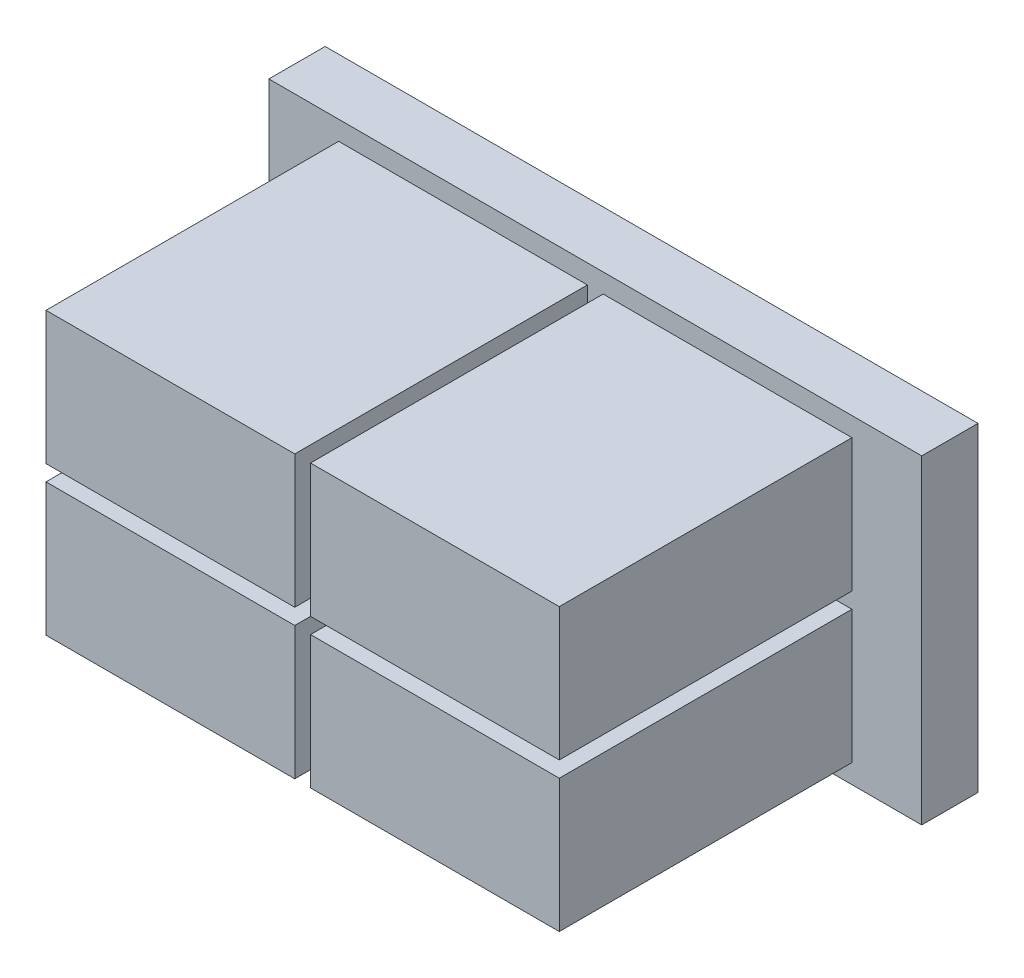
ISO-10303-21;
HEADER;
FILE_DESCRIPTION(('STEP AP214'),'2;1');
FILE_NAME('part.step','',(''),(''),'','','');
FILE_SCHEMA(('AUTOMOTIVE_DESIGN { 1 0 10303 214 1 1 1 1 }'));
ENDSEC;
DATA;
#1=APPLICATION_CONTEXT('core data for automotive mechanical design processes');
#2=APPLICATION_PROTOCOL_DEFINITION('international standard','automotive_design',2000,#1);
#3=PRODUCT_CONTEXT('',#1,'mechanical');
#4=PRODUCT('Part','Part','',(#3));
#5=PRODUCT_RELATED_PRODUCT_CATEGORY('part','',(#4));
#6=PRODUCT_DEFINITION_FORMATION('','',#4);
#7=PRODUCT_DEFINITION_CONTEXT('part definition',#1,'design');
#8=PRODUCT_DEFINITION('design','',#6,#7);
#9=PRODUCT_DEFINITION_SHAPE('','',#8);
#10=(LENGTH_UNIT() NAMED_UNIT(*) SI_UNIT(.MILLI.,.METRE.));
#11=(NAMED_UNIT(*) PLANE_ANGLE_UNIT() SI_UNIT($,.RADIAN.));
#12=(NAMED_UNIT(*) SI_UNIT($,.STERADIAN.) SOLID_ANGLE_UNIT());
#13=UNCERTAINTY_MEASURE_WITH_UNIT(LENGTH_MEASURE(1.E-05),#10,'distance_accuracy_value','');
#14=(GEOMETRIC_REPRESENTATION_CONTEXT(3) GLOBAL_UNCERTAINTY_ASSIGNED_CONTEXT((#13)) GLOBAL_UNIT_ASSIGNED_CONTEXT((#10,
#11,#12)) REPRESENTATION_CONTEXT('',''));
#15=CARTESIAN_POINT('',(0.,0.,0.));
#16=DIRECTION('',(0.,0.,1.));
#17=DIRECTION('',(1.,0.,0.));
#18=AXIS2_PLACEMENT_3D('',#15,#16,#17);
#19=CARTESIAN_POINT('',(0.,0.,2.5));
#20=DIRECTION('',(0.,0.,1.));
#21=DIRECTION('',(1.,0.,0.));
#22=AXIS2_PLACEMENT_3D('',#19,#20,#21);
#23=PLANE('',#22);
#24=DIRECTION('',(0.,1.,0.));
#25=VECTOR('',#24,1.);
#26=CARTESIAN_POINT('',(14.5,7.1,2.5));
#27=LINE('',#26,#25);
#28=CARTESIAN_POINT('',(14.5,-7.1,2.5));
#29=VERTEX_POINT('',#28);
#30=CARTESIAN_POINT('',(14.5,7.1,2.5));
#31=VERTEX_POINT('',#30);
#32=EDGE_CURVE('E286',#29,#31,#27,.T.);
#33=ORIENTED_EDGE('',*,*,#32,.T.);
#34=DIRECTION('',(-1.,0.,0.));
#35=VECTOR('',#34,1.);
#36=CARTESIAN_POINT('',(-14.5,7.1,2.5));
#37=LINE('',#36,#35);
#38=CARTESIAN_POINT('',(-14.5,7.1,2.5));
#39=VERTEX_POINT('',#38);
#40=EDGE_CURVE('E289',#31,#39,#37,.T.);
#41=ORIENTED_EDGE('',*,*,#40,.T.);
#42=DIRECTION('',(0.,-1.,0.));
#43=VECTOR('',#42,1.);
#44=CARTESIAN_POINT('',(-14.5,7.1,2.5));
#45=LINE('',#44,#43);
#46=CARTESIAN_POINT('',(-14.5,-7.1,2.5));
#47=VERTEX_POINT('',#46);
#48=EDGE_CURVE('E292',#39,#47,#45,.T.);
#49=ORIENTED_EDGE('',*,*,#48,.T.);
#50=DIRECTION('',(1.,0.,0.));
#51=VECTOR('',#50,1.);
#52=CARTESIAN_POINT('',(-14.5,-7.1,2.5));
#53=LINE('',#52,#51);
#54=EDGE_CURVE('E294',#47,#29,#53,.T.);
#55=ORIENTED_EDGE('',*,*,#54,.T.);
#56=EDGE_LOOP('',(#33,#41,#49,#55));
#57=FACE_BOUND('',#56,.T.);
#58=DIRECTION('',(-1.,0.,0.));
#59=VECTOR('',#58,1.);
#60=CARTESIAN_POINT('',(0.35,-0.35,2.5));
#61=LINE('',#60,#59);
#62=CARTESIAN_POINT('',(11.4,-0.35,2.5));
#63=VERTEX_POINT('',#62);
#64=CARTESIAN_POINT('',(0.35,-0.35,2.5));
#65=VERTEX_POINT('',#64);
#66=EDGE_CURVE('E270',#63,#65,#61,.T.);
#67=ORIENTED_EDGE('',*,*,#66,.F.);
#68=DIRECTION('',(0.,1.,0.));
#69=VECTOR('',#68,1.);
#70=CARTESIAN_POINT('',(11.4,-0.35,2.5));
#71=LINE('',#70,#69);
#72=CARTESIAN_POINT('',(11.4,-6.25,2.5));
#73=VERTEX_POINT('',#72);
#74=EDGE_CURVE('E256',#73,#63,#71,.T.);
#75=ORIENTED_EDGE('',*,*,#74,.F.);
#76=DIRECTION('',(1.,0.,0.));
#77=VECTOR('',#76,1.);
#78=CARTESIAN_POINT('',(0.35,-6.25,2.5));
#79=LINE('',#78,#77);
#80=CARTESIAN_POINT('',(0.35,-6.25,2.5));
#81=VERTEX_POINT('',#80);
#82=EDGE_CURVE('E261',#81,#73,#79,.T.);
#83=ORIENTED_EDGE('',*,*,#82,.F.);
#84=DIRECTION('',(0.,-1.,0.));
#85=VECTOR('',#84,1.);
#86=CARTESIAN_POINT('',(0.35,-0.35,2.5));
#87=LINE('',#86,#85);
#88=EDGE_CURVE('E272',#65,#81,#87,.T.);
#89=ORIENTED_EDGE('',*,*,#88,.F.);
#90=EDGE_LOOP('',(#67,#75,#83,#89));
#91=FACE_BOUND('',#90,.T.);
#92=DIRECTION('',(1.,0.,0.));
#93=VECTOR('',#92,1.);
#94=CARTESIAN_POINT('',(-11.4,0.35,2.5));
#95=LINE('',#94,#93);
#96=CARTESIAN_POINT('',(-11.4,0.35,2.5));
#97=VERTEX_POINT('',#96);
#98=CARTESIAN_POINT('',(-0.350000000000001,0.349999999999999,2.5));
#99=VERTEX_POINT('',#98);
#100=EDGE_CURVE('E241',#97,#99,#95,.T.);
#101=ORIENTED_EDGE('',*,*,#100,.F.);
#102=DIRECTION('',(0.,-1.,0.));
#103=VECTOR('',#102,1.);
#104=CARTESIAN_POINT('',(-11.4,6.25,2.5));
#105=LINE('',#104,#103);
#106=CARTESIAN_POINT('',(-11.4,6.25,2.5));
#107=VERTEX_POINT('',#106);
#108=EDGE_CURVE('E227',#107,#97,#105,.T.);
#109=ORIENTED_EDGE('',*,*,#108,.F.);
#110=DIRECTION('',(-1.,0.,0.));
#111=VECTOR('',#110,1.);
#112=CARTESIAN_POINT('',(-11.4,6.25,2.5));
#113=LINE('',#112,#111);
#114=CARTESIAN_POINT('',(-0.35,6.25,2.5));
#115=VERTEX_POINT('',#114);
#116=EDGE_CURVE('E232',#115,#107,#113,.T.);
#117=ORIENTED_EDGE('',*,*,#116,.F.);
#118=DIRECTION('',(0.,1.,0.));
#119=VECTOR('',#118,1.);
#120=CARTESIAN_POINT('',(-0.35,6.25,2.5));
#121=LINE('',#120,#119);
#122=EDGE_CURVE('E243',#99,#115,#121,.T.);
#123=ORIENTED_EDGE('',*,*,#122,.F.);
#124=EDGE_LOOP('',(#101,#109,#117,#123));
#125=FACE_BOUND('',#124,.T.);
#126=DIRECTION('',(1.,0.,0.));
#127=VECTOR('',#126,1.);
#128=CARTESIAN_POINT('',(-11.4,-6.25,2.5));
#129=LINE('',#128,#127);
#130=CARTESIAN_POINT('',(-11.4,-6.25,2.5));
#131=VERTEX_POINT('',#130);
#132=CARTESIAN_POINT('',(-0.35,-6.25,2.5));
#133=VERTEX_POINT('',#132);
#134=EDGE_CURVE('E199',#131,#133,#129,.T.);
#135=ORIENTED_EDGE('',*,*,#134,.F.);
#136=DIRECTION('',(0.,-1.,0.));
#137=VECTOR('',#136,1.);
#138=CARTESIAN_POINT('',(-11.4,-0.35,2.5));
#139=LINE('',#138,#137);
#140=CARTESIAN_POINT('',(-11.4,-0.35,2.5));
#141=VERTEX_POINT('',#140);
#142=EDGE_CURVE('E196',#141,#131,#139,.T.);
#143=ORIENTED_EDGE('',*,*,#142,.F.);
#144=DIRECTION('',(-1.,0.,0.));
#145=VECTOR('',#144,1.);
#146=CARTESIAN_POINT('',(-11.4,-0.35,2.5));
#147=LINE('',#146,#145);
#148=CARTESIAN_POINT('',(-0.350000000000001,-0.350000000000001,2.5));
#149=VERTEX_POINT('',#148);
#150=EDGE_CURVE('E208',#149,#141,#147,.T.);
#151=ORIENTED_EDGE('',*,*,#150,.F.);
#152=DIRECTION('',(0.,1.,0.));
#153=VECTOR('',#152,1.);
#154=CARTESIAN_POINT('',(-0.350000000000001,-0.350000000000001,2.5));
#155=LINE('',#154,#153);
#156=EDGE_CURVE('E216',#133,#149,#155,.T.);
#157=ORIENTED_EDGE('',*,*,#156,.F.);
#158=EDGE_LOOP('',(#135,#143,#151,#157));
#159=FACE_BOUND('',#158,.T.);
#160=DIRECTION('',(0.,-1.,0.));
#161=VECTOR('',#160,1.);
#162=CARTESIAN_POINT('',(0.35,6.25,2.5));
#163=LINE('',#162,#161);
#164=CARTESIAN_POINT('',(0.35,6.25,2.5));
#165=VERTEX_POINT('',#164);
#166=CARTESIAN_POINT('',(0.349999999999998,0.349999999999999,2.5));
#167=VERTEX_POINT('',#166);
#168=EDGE_CURVE('E575',#165,#167,#163,.T.);
#169=ORIENTED_EDGE('',*,*,#168,.F.);
#170=DIRECTION('',(-1.,0.,0.));
#171=VECTOR('',#170,1.);
#172=CARTESIAN_POINT('',(0.35,6.25,2.5));
#173=LINE('',#172,#171);
#174=CARTESIAN_POINT('',(11.4,6.25,2.5));
#175=VERTEX_POINT('',#174);
#176=EDGE_CURVE('E194',#175,#165,#173,.T.);
#177=ORIENTED_EDGE('',*,*,#176,.F.);
#178=DIRECTION('',(0.,1.,0.));
#179=VECTOR('',#178,1.);
#180=CARTESIAN_POINT('',(11.4,6.25,2.5));
#181=LINE('',#180,#179);
#182=CARTESIAN_POINT('',(11.4,0.35,2.5));
#183=VERTEX_POINT('',#182);
#184=EDGE_CURVE('E190',#183,#175,#181,.T.);
#185=ORIENTED_EDGE('',*,*,#184,.F.);
#186=DIRECTION('',(1.,0.,0.));
#187=VECTOR('',#186,1.);
#188=CARTESIAN_POINT('',(0.349999999999998,0.349999999999999,2.5));
#189=LINE('',#188,#187);
#190=EDGE_CURVE('E572',#167,#183,#189,.T.);
#191=ORIENTED_EDGE('',*,*,#190,.F.);
#192=EDGE_LOOP('',(#169,#177,#185,#191));
#193=FACE_BOUND('',#192,.T.);
#194=ADVANCED_FACE('F33',(#57,#91,#125,#159,#193),#23,.T.);
#195=CARTESIAN_POINT('',(14.5,7.1,2.5));
#196=DIRECTION('',(-1.,0.,0.));
#197=DIRECTION('',(0.,-1.,0.));
#198=AXIS2_PLACEMENT_3D('',#195,#196,#197);
#199=PLANE('',#198);
#200=DIRECTION('',(0.,1.,0.));
#201=VECTOR('',#200,1.);
#202=CARTESIAN_POINT('',(14.5,7.1,0.));
#203=LINE('',#202,#201);
#204=CARTESIAN_POINT('',(14.5,-7.1,0.));
#205=VERTEX_POINT('',#204);
#206=CARTESIAN_POINT('',(14.5,7.1,0.));
#207=VERTEX_POINT('',#206);
#208=EDGE_CURVE('E285',#205,#207,#203,.T.);
#209=ORIENTED_EDGE('',*,*,#208,.T.);
#210=DIRECTION('',(0.,0.,-1.));
#211=VECTOR('',#210,1.);
#212=CARTESIAN_POINT('',(14.5,7.1,2.5));
#213=LINE('',#212,#211);
#214=EDGE_CURVE('E11',#31,#207,#213,.T.);
#215=ORIENTED_EDGE('',*,*,#214,.F.);
#216=ORIENTED_EDGE('',*,*,#32,.F.);
#217=DIRECTION('',(0.,0.,-1.));
#218=VECTOR('',#217,1.);
#219=CARTESIAN_POINT('',(14.5,-7.1,2.5));
#220=LINE('',#219,#218);
#221=EDGE_CURVE('E296',#29,#205,#220,.T.);
#222=ORIENTED_EDGE('',*,*,#221,.T.);
#223=EDGE_LOOP('',(#209,#215,#216,#222));
#224=FACE_BOUND('',#223,.T.);
#225=ADVANCED_FACE('F35',(#224),#199,.F.);
#226=CARTESIAN_POINT('',(-14.5,7.1,2.5));
#227=DIRECTION('',(0.,-1.,0.));
#228=DIRECTION('',(0.,0.,-1.));
#229=AXIS2_PLACEMENT_3D('',#226,#227,#228);
#230=PLANE('',#229);
#231=DIRECTION('',(-1.,0.,0.));
#232=VECTOR('',#231,1.);
#233=CARTESIAN_POINT('',(-14.5,7.1,0.));
#234=LINE('',#233,#232);
#235=CARTESIAN_POINT('',(-14.5,7.1,0.));
#236=VERTEX_POINT('',#235);
#237=EDGE_CURVE('E299',#207,#236,#234,.T.);
#238=ORIENTED_EDGE('',*,*,#237,.T.);
#239=DIRECTION('',(0.,0.,-1.));
#240=VECTOR('',#239,1.);
#241=CARTESIAN_POINT('',(-14.5,7.1,2.5));
#242=LINE('',#241,#240);
#243=EDGE_CURVE('E41',#39,#236,#242,.T.);
#244=ORIENTED_EDGE('',*,*,#243,.F.);
#245=ORIENTED_EDGE('',*,*,#40,.F.);
#246=ORIENTED_EDGE('',*,*,#214,.T.);
#247=EDGE_LOOP('',(#238,#244,#245,#246));
#248=FACE_BOUND('',#247,.T.);
#249=ADVANCED_FACE('F329',(#248),#230,.F.);
#250=CARTESIAN_POINT('',(-14.5,7.1,2.5));
#251=DIRECTION('',(1.,0.,0.));
#252=DIRECTION('',(0.,1.,0.));
#253=AXIS2_PLACEMENT_3D('',#250,#251,#252);
#254=PLANE('',#253);
#255=DIRECTION('',(0.,-1.,0.));
#256=VECTOR('',#255,1.);
#257=CARTESIAN_POINT('',(-14.5,7.1,0.));
#258=LINE('',#257,#256);
#259=CARTESIAN_POINT('',(-14.5,-7.1,0.));
#260=VERTEX_POINT('',#259);
#261=EDGE_CURVE('E301',#236,#260,#258,.T.);
#262=ORIENTED_EDGE('',*,*,#261,.T.);
#263=DIRECTION('',(0.,0.,-1.));
#264=VECTOR('',#263,1.);
#265=CARTESIAN_POINT('',(-14.5,-7.1,2.5));
#266=LINE('',#265,#264);
#267=EDGE_CURVE('E306',#47,#260,#266,.T.);
#268=ORIENTED_EDGE('',*,*,#267,.F.);
#269=ORIENTED_EDGE('',*,*,#48,.F.);
#270=ORIENTED_EDGE('',*,*,#243,.T.);
#271=EDGE_LOOP('',(#262,#268,#269,#270));
#272=FACE_BOUND('',#271,.T.);
#273=ADVANCED_FACE('F313',(#272),#254,.F.);
#274=CARTESIAN_POINT('',(-14.5,-7.1,2.5));
#275=DIRECTION('',(0.,1.,0.));
#276=DIRECTION('',(0.,0.,1.));
#277=AXIS2_PLACEMENT_3D('',#274,#275,#276);
#278=PLANE('',#277);
#279=DIRECTION('',(1.,0.,0.));
#280=VECTOR('',#279,1.);
#281=CARTESIAN_POINT('',(-14.5,-7.1,0.));
#282=LINE('',#281,#280);
#283=EDGE_CURVE('E290',#260,#205,#282,.T.);
#284=ORIENTED_EDGE('',*,*,#283,.T.);
#285=ORIENTED_EDGE('',*,*,#221,.F.);
#286=ORIENTED_EDGE('',*,*,#54,.F.);
#287=ORIENTED_EDGE('',*,*,#267,.T.);
#288=EDGE_LOOP('',(#284,#285,#286,#287));
#289=FACE_BOUND('',#288,.T.);
#290=ADVANCED_FACE('F322',(#289),#278,.F.);
#291=CARTESIAN_POINT('',(0.,0.,0.));
#292=DIRECTION('',(0.,0.,1.));
#293=DIRECTION('',(1.,0.,0.));
#294=AXIS2_PLACEMENT_3D('',#291,#292,#293);
#295=PLANE('',#294);
#296=ORIENTED_EDGE('',*,*,#208,.F.);
#297=ORIENTED_EDGE('',*,*,#283,.F.);
#298=ORIENTED_EDGE('',*,*,#261,.F.);
#299=ORIENTED_EDGE('',*,*,#237,.F.);
#300=EDGE_LOOP('',(#296,#297,#298,#299));
#301=FACE_BOUND('',#300,.T.);
#302=ADVANCED_FACE('F319',(#301),#295,.F.);
#303=CARTESIAN_POINT('',(11.4,-0.35,15.5));
#304=DIRECTION('',(-1.,0.,0.));
#305=DIRECTION('',(0.,-1.,0.));
#306=AXIS2_PLACEMENT_3D('',#303,#304,#305);
#307=PLANE('',#306);
#308=ORIENTED_EDGE('',*,*,#74,.T.);
#309=DIRECTION('',(0.,0.,-1.));
#310=VECTOR('',#309,1.);
#311=CARTESIAN_POINT('',(11.4,-0.35,15.5));
#312=LINE('',#311,#310);
#313=CARTESIAN_POINT('',(11.4,-0.35,15.5));
#314=VERTEX_POINT('',#313);
#315=EDGE_CURVE('E283',#314,#63,#312,.T.);
#316=ORIENTED_EDGE('',*,*,#315,.F.);
#317=DIRECTION('',(0.,1.,0.));
#318=VECTOR('',#317,1.);
#319=CARTESIAN_POINT('',(11.4,-0.35,15.5));
#320=LINE('',#319,#318);
#321=CARTESIAN_POINT('',(11.4,-6.25,15.5));
#322=VERTEX_POINT('',#321);
#323=EDGE_CURVE('E257',#322,#314,#320,.T.);
#324=ORIENTED_EDGE('',*,*,#323,.F.);
#325=DIRECTION('',(0.,0.,-1.));
#326=VECTOR('',#325,1.);
#327=CARTESIAN_POINT('',(11.4,-6.25,15.5));
#328=LINE('',#327,#326);
#329=EDGE_CURVE('E267',#322,#73,#328,.T.);
#330=ORIENTED_EDGE('',*,*,#329,.T.);
#331=EDGE_LOOP('',(#308,#316,#324,#330));
#332=FACE_BOUND('',#331,.T.);
#333=ADVANCED_FACE('F342',(#332),#307,.F.);
#334=CARTESIAN_POINT('',(0.35,-0.35,15.5));
#335=DIRECTION('',(0.,-1.,0.));
#336=DIRECTION('',(1.,0.,0.));
#337=AXIS2_PLACEMENT_3D('',#334,#335,#336);
#338=PLANE('',#337);
#339=ORIENTED_EDGE('',*,*,#66,.T.);
#340=DIRECTION('',(0.,0.,-1.));
#341=VECTOR('',#340,1.);
#342=CARTESIAN_POINT('',(0.35,-0.35,15.5));
#343=LINE('',#342,#341);
#344=CARTESIAN_POINT('',(0.35,-0.35,15.5));
#345=VERTEX_POINT('',#344);
#346=EDGE_CURVE('E280',#345,#65,#343,.T.);
#347=ORIENTED_EDGE('',*,*,#346,.F.);
#348=DIRECTION('',(-1.,0.,0.));
#349=VECTOR('',#348,1.);
#350=CARTESIAN_POINT('',(0.35,-0.35,15.5));
#351=LINE('',#350,#349);
#352=EDGE_CURVE('E260',#314,#345,#351,.T.);
#353=ORIENTED_EDGE('',*,*,#352,.F.);
#354=ORIENTED_EDGE('',*,*,#315,.T.);
#355=EDGE_LOOP('',(#339,#347,#353,#354));
#356=FACE_BOUND('',#355,.T.);
#357=ADVANCED_FACE('F361',(#356),#338,.F.);
#358=CARTESIAN_POINT('',(0.35,-0.35,15.5));
#359=DIRECTION('',(1.,0.,0.));
#360=DIRECTION('',(0.,1.,0.));
#361=AXIS2_PLACEMENT_3D('',#358,#359,#360);
#362=PLANE('',#361);
#363=ORIENTED_EDGE('',*,*,#88,.T.);
#364=DIRECTION('',(0.,0.,-1.));
#365=VECTOR('',#364,1.);
#366=CARTESIAN_POINT('',(0.35,-6.25,15.5));
#367=LINE('',#366,#365);
#368=CARTESIAN_POINT('',(0.35,-6.25,15.5));
#369=VERTEX_POINT('',#368);
#370=EDGE_CURVE('E278',#369,#81,#367,.T.);
#371=ORIENTED_EDGE('',*,*,#370,.F.);
#372=DIRECTION('',(0.,-1.,0.));
#373=VECTOR('',#372,1.);
#374=CARTESIAN_POINT('',(0.35,-0.35,15.5));
#375=LINE('',#374,#373);
#376=EDGE_CURVE('E263',#345,#369,#375,.T.);
#377=ORIENTED_EDGE('',*,*,#376,.F.);
#378=ORIENTED_EDGE('',*,*,#346,.T.);
#379=EDGE_LOOP('',(#363,#371,#377,#378));
#380=FACE_BOUND('',#379,.T.);
#381=ADVANCED_FACE('F368',(#380),#362,.F.);
#382=CARTESIAN_POINT('',(0.35,-6.25,15.5));
#383=DIRECTION('',(0.,1.,0.));
#384=DIRECTION('',(0.,0.,1.));
#385=AXIS2_PLACEMENT_3D('',#382,#383,#384);
#386=PLANE('',#385);
#387=ORIENTED_EDGE('',*,*,#82,.T.);
#388=ORIENTED_EDGE('',*,*,#329,.F.);
#389=DIRECTION('',(1.,0.,0.));
#390=VECTOR('',#389,1.);
#391=CARTESIAN_POINT('',(0.35,-6.25,15.5));
#392=LINE('',#391,#390);
#393=EDGE_CURVE('E265',#369,#322,#392,.T.);
#394=ORIENTED_EDGE('',*,*,#393,.F.);
#395=ORIENTED_EDGE('',*,*,#370,.T.);
#396=EDGE_LOOP('',(#387,#388,#394,#395));
#397=FACE_BOUND('',#396,.T.);
#398=ADVANCED_FACE('F375',(#397),#386,.F.);
#399=CARTESIAN_POINT('',(0.,0.,15.5));
#400=DIRECTION('',(0.,0.,1.));
#401=DIRECTION('',(1.,0.,0.));
#402=AXIS2_PLACEMENT_3D('',#399,#400,#401);
#403=PLANE('',#402);
#404=ORIENTED_EDGE('',*,*,#323,.T.);
#405=ORIENTED_EDGE('',*,*,#352,.T.);
#406=ORIENTED_EDGE('',*,*,#376,.T.);
#407=ORIENTED_EDGE('',*,*,#393,.T.);
#408=EDGE_LOOP('',(#404,#405,#406,#407));
#409=FACE_BOUND('',#408,.T.);
#410=ADVANCED_FACE('F383',(#409),#403,.T.);
#411=CARTESIAN_POINT('',(-11.4,6.25,15.5));
#412=DIRECTION('',(1.,0.,0.));
#413=DIRECTION('',(0.,1.,0.));
#414=AXIS2_PLACEMENT_3D('',#411,#412,#413);
#415=PLANE('',#414);
#416=ORIENTED_EDGE('',*,*,#108,.T.);
#417=DIRECTION('',(0.,0.,-1.));
#418=VECTOR('',#417,1.);
#419=CARTESIAN_POINT('',(-11.4,0.35,15.5));
#420=LINE('',#419,#418);
#421=CARTESIAN_POINT('',(-11.4,0.35,15.5));
#422=VERTEX_POINT('',#421);
#423=EDGE_CURVE('E254',#422,#97,#420,.T.);
#424=ORIENTED_EDGE('',*,*,#423,.F.);
#425=DIRECTION('',(0.,-1.,0.));
#426=VECTOR('',#425,1.);
#427=CARTESIAN_POINT('',(-11.4,6.25,15.5));
#428=LINE('',#427,#426);
#429=CARTESIAN_POINT('',(-11.4,6.25,15.5));
#430=VERTEX_POINT('',#429);
#431=EDGE_CURVE('E228',#430,#422,#428,.T.);
#432=ORIENTED_EDGE('',*,*,#431,.F.);
#433=DIRECTION('',(0.,0.,-1.));
#434=VECTOR('',#433,1.);
#435=CARTESIAN_POINT('',(-11.4,6.25,15.5));
#436=LINE('',#435,#434);
#437=EDGE_CURVE('E238',#430,#107,#436,.T.);
#438=ORIENTED_EDGE('',*,*,#437,.T.);
#439=EDGE_LOOP('',(#416,#424,#432,#438));
#440=FACE_BOUND('',#439,.T.);
#441=ADVANCED_FACE('F391',(#440),#415,.F.);
#442=CARTESIAN_POINT('',(-11.4,0.35,15.5));
#443=DIRECTION('',(0.,1.,0.));
#444=DIRECTION('',(-1.,0.,0.));
#445=AXIS2_PLACEMENT_3D('',#442,#443,#444);
#446=PLANE('',#445);
#447=ORIENTED_EDGE('',*,*,#100,.T.);
#448=DIRECTION('',(0.,0.,-1.));
#449=VECTOR('',#448,1.);
#450=CARTESIAN_POINT('',(-0.350000000000001,0.349999999999999,15.5));
#451=LINE('',#450,#449);
#452=CARTESIAN_POINT('',(-0.350000000000001,0.349999999999999,15.5));
#453=VERTEX_POINT('',#452);
#454=EDGE_CURVE('E251',#453,#99,#451,.T.);
#455=ORIENTED_EDGE('',*,*,#454,.F.);
#456=DIRECTION('',(1.,0.,0.));
#457=VECTOR('',#456,1.);
#458=CARTESIAN_POINT('',(-11.4,0.35,15.5));
#459=LINE('',#458,#457);
#460=EDGE_CURVE('E231',#422,#453,#459,.T.);
#461=ORIENTED_EDGE('',*,*,#460,.F.);
#462=ORIENTED_EDGE('',*,*,#423,.T.);
#463=EDGE_LOOP('',(#447,#455,#461,#462));
#464=FACE_BOUND('',#463,.T.);
#465=ADVANCED_FACE('F399',(#464),#446,.F.);
#466=CARTESIAN_POINT('',(-0.35,6.25,15.5));
#467=DIRECTION('',(-1.,0.,0.));
#468=DIRECTION('',(0.,-1.,0.));
#469=AXIS2_PLACEMENT_3D('',#466,#467,#468);
#470=PLANE('',#469);
#471=ORIENTED_EDGE('',*,*,#122,.T.);
#472=DIRECTION('',(0.,0.,-1.));
#473=VECTOR('',#472,1.);
#474=CARTESIAN_POINT('',(-0.35,6.25,15.5));
#475=LINE('',#474,#473);
#476=CARTESIAN_POINT('',(-0.35,6.25,15.5));
#477=VERTEX_POINT('',#476);
#478=EDGE_CURVE('E249',#477,#115,#475,.T.);
#479=ORIENTED_EDGE('',*,*,#478,.F.);
#480=DIRECTION('',(0.,1.,0.));
#481=VECTOR('',#480,1.);
#482=CARTESIAN_POINT('',(-0.35,6.25,15.5));
#483=LINE('',#482,#481);
#484=EDGE_CURVE('E234',#453,#477,#483,.T.);
#485=ORIENTED_EDGE('',*,*,#484,.F.);
#486=ORIENTED_EDGE('',*,*,#454,.T.);
#487=EDGE_LOOP('',(#471,#479,#485,#486));
#488=FACE_BOUND('',#487,.T.);
#489=ADVANCED_FACE('F407',(#488),#470,.F.);
#490=CARTESIAN_POINT('',(-11.4,6.25,15.5));
#491=DIRECTION('',(0.,-1.,0.));
#492=DIRECTION('',(0.,0.,-1.));
#493=AXIS2_PLACEMENT_3D('',#490,#491,#492);
#494=PLANE('',#493);
#495=ORIENTED_EDGE('',*,*,#116,.T.);
#496=ORIENTED_EDGE('',*,*,#437,.F.);
#497=DIRECTION('',(-1.,0.,0.));
#498=VECTOR('',#497,1.);
#499=CARTESIAN_POINT('',(-11.4,6.25,15.5));
#500=LINE('',#499,#498);
#501=EDGE_CURVE('E236',#477,#430,#500,.T.);
#502=ORIENTED_EDGE('',*,*,#501,.F.);
#503=ORIENTED_EDGE('',*,*,#478,.T.);
#504=EDGE_LOOP('',(#495,#496,#502,#503));
#505=FACE_BOUND('',#504,.T.);
#506=ADVANCED_FACE('F415',(#505),#494,.F.);
#507=CARTESIAN_POINT('',(0.,0.,15.5));
#508=DIRECTION('',(0.,0.,1.));
#509=DIRECTION('',(1.,0.,0.));
#510=AXIS2_PLACEMENT_3D('',#507,#508,#509);
#511=PLANE('',#510);
#512=ORIENTED_EDGE('',*,*,#431,.T.);
#513=ORIENTED_EDGE('',*,*,#460,.T.);
#514=ORIENTED_EDGE('',*,*,#484,.T.);
#515=ORIENTED_EDGE('',*,*,#501,.T.);
#516=EDGE_LOOP('',(#512,#513,#514,#515));
#517=FACE_BOUND('',#516,.T.);
#518=ADVANCED_FACE('F423',(#517),#511,.T.);
#519=CARTESIAN_POINT('',(-11.4,-0.35,15.5));
#520=DIRECTION('',(1.,0.,0.));
#521=DIRECTION('',(0.,1.,0.));
#522=AXIS2_PLACEMENT_3D('',#519,#520,#521);
#523=PLANE('',#522);
#524=ORIENTED_EDGE('',*,*,#142,.T.);
#525=DIRECTION('',(0.,0.,-1.));
#526=VECTOR('',#525,1.);
#527=CARTESIAN_POINT('',(-11.4,-6.25,15.5));
#528=LINE('',#527,#526);
#529=CARTESIAN_POINT('',(-11.4,-6.25,15.5));
#530=VERTEX_POINT('',#529);
#531=EDGE_CURVE('E225',#530,#131,#528,.T.);
#532=ORIENTED_EDGE('',*,*,#531,.F.);
#533=DIRECTION('',(0.,-1.,0.));
#534=VECTOR('',#533,1.);
#535=CARTESIAN_POINT('',(-11.4,-0.35,15.5));
#536=LINE('',#535,#534);
#537=CARTESIAN_POINT('',(-11.4,-0.35,15.5));
#538=VERTEX_POINT('',#537);
#539=EDGE_CURVE('E204',#538,#530,#536,.T.);
#540=ORIENTED_EDGE('',*,*,#539,.F.);
#541=DIRECTION('',(0.,0.,-1.));
#542=VECTOR('',#541,1.);
#543=CARTESIAN_POINT('',(-11.4,-0.35,15.5));
#544=LINE('',#543,#542);
#545=EDGE_CURVE('E213',#538,#141,#544,.T.);
#546=ORIENTED_EDGE('',*,*,#545,.T.);
#547=EDGE_LOOP('',(#524,#532,#540,#546));
#548=FACE_BOUND('',#547,.T.);
#549=ADVANCED_FACE('F431',(#548),#523,.F.);
#550=CARTESIAN_POINT('',(-11.4,-6.25,15.5));
#551=DIRECTION('',(0.,1.,0.));
#552=DIRECTION('',(0.,0.,1.));
#553=AXIS2_PLACEMENT_3D('',#550,#551,#552);
#554=PLANE('',#553);
#555=ORIENTED_EDGE('',*,*,#134,.T.);
#556=DIRECTION('',(0.,0.,-1.));
#557=VECTOR('',#556,1.);
#558=CARTESIAN_POINT('',(-0.35,-6.25,15.5));
#559=LINE('',#558,#557);
#560=CARTESIAN_POINT('',(-0.35,-6.25,15.5));
#561=VERTEX_POINT('',#560);
#562=EDGE_CURVE('E222',#561,#133,#559,.T.);
#563=ORIENTED_EDGE('',*,*,#562,.F.);
#564=DIRECTION('',(1.,0.,0.));
#565=VECTOR('',#564,1.);
#566=CARTESIAN_POINT('',(-11.4,-6.25,15.5));
#567=LINE('',#566,#565);
#568=EDGE_CURVE('E207',#530,#561,#567,.T.);
#569=ORIENTED_EDGE('',*,*,#568,.F.);
#570=ORIENTED_EDGE('',*,*,#531,.T.);
#571=EDGE_LOOP('',(#555,#563,#569,#570));
#572=FACE_BOUND('',#571,.T.);
#573=ADVANCED_FACE('F439',(#572),#554,.F.);
#574=CARTESIAN_POINT('',(-0.350000000000001,-0.350000000000001,15.5));
#575=DIRECTION('',(-1.,0.,0.));
#576=DIRECTION('',(0.,-1.,0.));
#577=AXIS2_PLACEMENT_3D('',#574,#575,#576);
#578=PLANE('',#577);
#579=ORIENTED_EDGE('',*,*,#156,.T.);
#580=DIRECTION('',(0.,0.,-1.));
#581=VECTOR('',#580,1.);
#582=CARTESIAN_POINT('',(-0.350000000000001,-0.350000000000001,15.5));
#583=LINE('',#582,#581);
#584=CARTESIAN_POINT('',(-0.350000000000001,-0.350000000000001,15.5));
#585=VERTEX_POINT('',#584);
#586=EDGE_CURVE('E56',#585,#149,#583,.T.);
#587=ORIENTED_EDGE('',*,*,#586,.F.);
#588=DIRECTION('',(0.,1.,0.));
#589=VECTOR('',#588,1.);
#590=CARTESIAN_POINT('',(-0.350000000000001,-0.350000000000001,15.5));
#591=LINE('',#590,#589);
#592=EDGE_CURVE('E210',#561,#585,#591,.T.);
#593=ORIENTED_EDGE('',*,*,#592,.F.);
#594=ORIENTED_EDGE('',*,*,#562,.T.);
#595=EDGE_LOOP('',(#579,#587,#593,#594));
#596=FACE_BOUND('',#595,.T.);
#597=ADVANCED_FACE('F447',(#596),#578,.F.);
#598=CARTESIAN_POINT('',(-11.4,-0.35,15.5));
#599=DIRECTION('',(0.,-1.,0.));
#600=DIRECTION('',(1.,0.,0.));
#601=AXIS2_PLACEMENT_3D('',#598,#599,#600);
#602=PLANE('',#601);
#603=ORIENTED_EDGE('',*,*,#150,.T.);
#604=ORIENTED_EDGE('',*,*,#545,.F.);
#605=DIRECTION('',(-1.,0.,0.));
#606=VECTOR('',#605,1.);
#607=CARTESIAN_POINT('',(-11.4,-0.35,15.5));
#608=LINE('',#607,#606);
#609=EDGE_CURVE('E212',#585,#538,#608,.T.);
#610=ORIENTED_EDGE('',*,*,#609,.F.);
#611=ORIENTED_EDGE('',*,*,#586,.T.);
#612=EDGE_LOOP('',(#603,#604,#610,#611));
#613=FACE_BOUND('',#612,.T.);
#614=ADVANCED_FACE('F455',(#613),#602,.F.);
#615=CARTESIAN_POINT('',(0.,0.,15.5));
#616=DIRECTION('',(0.,0.,1.));
#617=DIRECTION('',(1.,0.,0.));
#618=AXIS2_PLACEMENT_3D('',#615,#616,#617);
#619=PLANE('',#618);
#620=ORIENTED_EDGE('',*,*,#539,.T.);
#621=ORIENTED_EDGE('',*,*,#568,.T.);
#622=ORIENTED_EDGE('',*,*,#592,.T.);
#623=ORIENTED_EDGE('',*,*,#609,.T.);
#624=EDGE_LOOP('',(#620,#621,#622,#623));
#625=FACE_BOUND('',#624,.T.);
#626=ADVANCED_FACE('F463',(#625),#619,.T.);
#627=CARTESIAN_POINT('',(0.35,6.25,15.5));
#628=DIRECTION('',(0.,-1.,0.));
#629=DIRECTION('',(0.,0.,-1.));
#630=AXIS2_PLACEMENT_3D('',#627,#628,#629);
#631=PLANE('',#630);
#632=ORIENTED_EDGE('',*,*,#176,.T.);
#633=DIRECTION('',(0.,0.,-1.));
#634=VECTOR('',#633,1.);
#635=CARTESIAN_POINT('',(0.35,6.25,15.5));
#636=LINE('',#635,#634);
#637=CARTESIAN_POINT('',(0.35,6.25,15.5));
#638=VERTEX_POINT('',#637);
#639=EDGE_CURVE('E175',#638,#165,#636,.T.);
#640=ORIENTED_EDGE('',*,*,#639,.F.);
#641=DIRECTION('',(-1.,0.,0.));
#642=VECTOR('',#641,1.);
#643=CARTESIAN_POINT('',(0.35,6.25,15.5));
#644=LINE('',#643,#642);
#645=CARTESIAN_POINT('',(11.4,6.25,15.5));
#646=VERTEX_POINT('',#645);
#647=EDGE_CURVE('E182',#646,#638,#644,.T.);
#648=ORIENTED_EDGE('',*,*,#647,.F.);
#649=DIRECTION('',(0.,0.,-1.));
#650=VECTOR('',#649,1.);
#651=CARTESIAN_POINT('',(11.4,6.25,15.5));
#652=LINE('',#651,#650);
#653=EDGE_CURVE('E569',#646,#175,#652,.T.);
#654=ORIENTED_EDGE('',*,*,#653,.T.);
#655=EDGE_LOOP('',(#632,#640,#648,#654));
#656=FACE_BOUND('',#655,.T.);
#657=ADVANCED_FACE('F192',(#656),#631,.F.);
#658=CARTESIAN_POINT('',(0.35,6.25,15.5));
#659=DIRECTION('',(1.,0.,0.));
#660=DIRECTION('',(0.,1.,0.));
#661=AXIS2_PLACEMENT_3D('',#658,#659,#660);
#662=PLANE('',#661);
#663=ORIENTED_EDGE('',*,*,#168,.T.);
#664=DIRECTION('',(0.,0.,-1.));
#665=VECTOR('',#664,1.);
#666=CARTESIAN_POINT('',(0.349999999999998,0.349999999999999,15.5));
#667=LINE('',#666,#665);
#668=CARTESIAN_POINT('',(0.349999999999998,0.349999999999999,15.5));
#669=VERTEX_POINT('',#668);
#670=EDGE_CURVE('E178',#669,#167,#667,.T.);
#671=ORIENTED_EDGE('',*,*,#670,.F.);
#672=DIRECTION('',(0.,-1.,0.));
#673=VECTOR('',#672,1.);
#674=CARTESIAN_POINT('',(0.35,6.25,15.5));
#675=LINE('',#674,#673);
#676=EDGE_CURVE('E171',#638,#669,#675,.T.);
#677=ORIENTED_EDGE('',*,*,#676,.F.);
#678=ORIENTED_EDGE('',*,*,#639,.T.);
#679=EDGE_LOOP('',(#663,#671,#677,#678));
#680=FACE_BOUND('',#679,.T.);
#681=ADVANCED_FACE('F173',(#680),#662,.F.);
#682=CARTESIAN_POINT('',(0.349999999999998,0.349999999999999,15.5));
#683=DIRECTION('',(0.,1.,0.));
#684=DIRECTION('',(-1.,0.,0.));
#685=AXIS2_PLACEMENT_3D('',#682,#683,#684);
#686=PLANE('',#685);
#687=ORIENTED_EDGE('',*,*,#190,.T.);
#688=DIRECTION('',(0.,0.,-1.));
#689=VECTOR('',#688,1.);
#690=CARTESIAN_POINT('',(11.4,0.35,15.5));
#691=LINE('',#690,#689);
#692=CARTESIAN_POINT('',(11.4,0.35,15.5));
#693=VERTEX_POINT('',#692);
#694=EDGE_CURVE('E48',#693,#183,#691,.T.);
#695=ORIENTED_EDGE('',*,*,#694,.F.);
#696=DIRECTION('',(1.,0.,0.));
#697=VECTOR('',#696,1.);
#698=CARTESIAN_POINT('',(0.349999999999998,0.349999999999999,15.5));
#699=LINE('',#698,#697);
#700=EDGE_CURVE('E181',#669,#693,#699,.T.);
#701=ORIENTED_EDGE('',*,*,#700,.F.);
#702=ORIENTED_EDGE('',*,*,#670,.T.);
#703=EDGE_LOOP('',(#687,#695,#701,#702));
#704=FACE_BOUND('',#703,.T.);
#705=ADVANCED_FACE('F483',(#704),#686,.F.);
#706=CARTESIAN_POINT('',(11.4,6.25,15.5));
#707=DIRECTION('',(-1.,0.,0.));
#708=DIRECTION('',(0.,-1.,0.));
#709=AXIS2_PLACEMENT_3D('',#706,#707,#708);
#710=PLANE('',#709);
#711=ORIENTED_EDGE('',*,*,#184,.T.);
#712=ORIENTED_EDGE('',*,*,#653,.F.);
#713=DIRECTION('',(0.,1.,0.));
#714=VECTOR('',#713,1.);
#715=CARTESIAN_POINT('',(11.4,6.25,15.5));
#716=LINE('',#715,#714);
#717=EDGE_CURVE('E186',#693,#646,#716,.T.);
#718=ORIENTED_EDGE('',*,*,#717,.F.);
#719=ORIENTED_EDGE('',*,*,#694,.T.);
#720=EDGE_LOOP('',(#711,#712,#718,#719));
#721=FACE_BOUND('',#720,.T.);
#722=ADVANCED_FACE('F490',(#721),#710,.F.);
#723=CARTESIAN_POINT('',(0.,0.,15.5));
#724=DIRECTION('',(0.,0.,-1.));
#725=DIRECTION('',(-1.,0.,0.));
#726=AXIS2_PLACEMENT_3D('',#723,#724,#725);
#727=PLANE('',#726);
#728=ORIENTED_EDGE('',*,*,#647,.T.);
#729=ORIENTED_EDGE('',*,*,#676,.T.);
#730=ORIENTED_EDGE('',*,*,#700,.T.);
#731=ORIENTED_EDGE('',*,*,#717,.T.);
#732=EDGE_LOOP('',(#728,#729,#730,#731));
#733=FACE_BOUND('',#732,.T.);
#734=ADVANCED_FACE('F185',(#733),#727,.F.);
#735=CLOSED_SHELL('',(#194,#225,#249,#273,#290,#302,#333,#357,#381,#398,#410,#441,#465,#489,
#506,#518,#549,#573,#597,#614,#626,#657,#681,#705,#722,#734));
#736=MANIFOLD_SOLID_BREP('B2',#735);
#737=ADVANCED_BREP_SHAPE_REPRESENTATION('',(#18,#736),#14);
#738=SHAPE_DEFINITION_REPRESENTATION(#9,#737);
ENDSEC;
END-ISO-10303-21;
